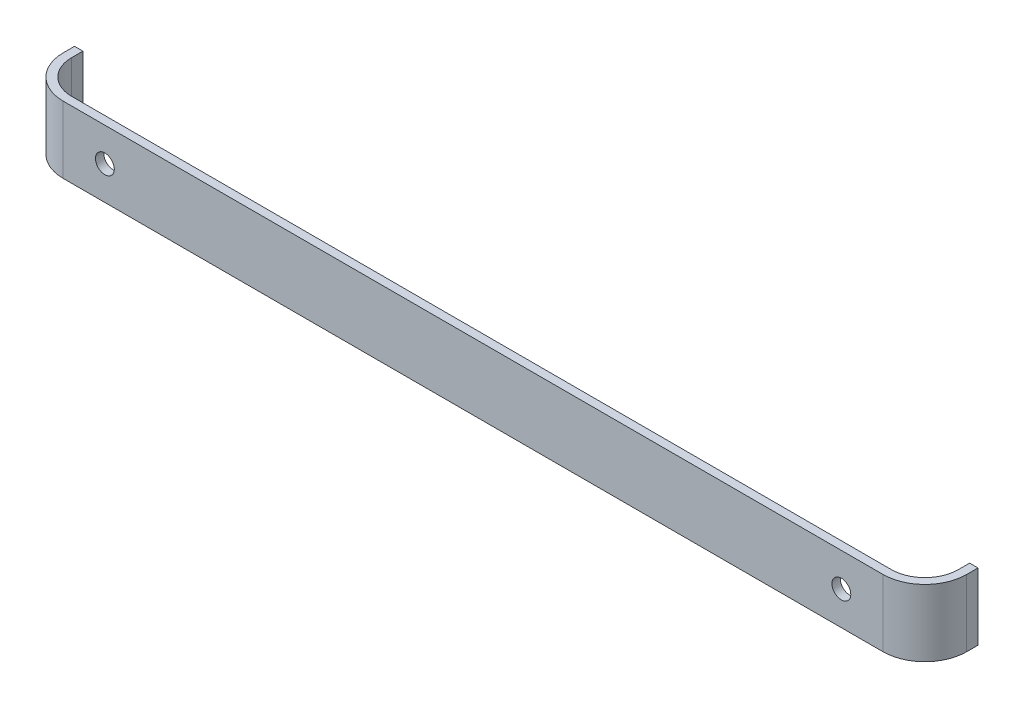
ISO-10303-21;
HEADER;
FILE_DESCRIPTION(('STEP AP214'),'2;1');
FILE_NAME('part.step','',(''),(''),'','','');
FILE_SCHEMA(('AUTOMOTIVE_DESIGN { 1 0 10303 214 1 1 1 1 }'));
ENDSEC;
DATA;
#1=APPLICATION_CONTEXT('core data for automotive mechanical design processes');
#2=APPLICATION_PROTOCOL_DEFINITION('international standard','automotive_design',2000,#1);
#3=PRODUCT_CONTEXT('',#1,'mechanical');
#4=PRODUCT('Part','Part','',(#3));
#5=PRODUCT_RELATED_PRODUCT_CATEGORY('part','',(#4));
#6=PRODUCT_DEFINITION_FORMATION('','',#4);
#7=PRODUCT_DEFINITION_CONTEXT('part definition',#1,'design');
#8=PRODUCT_DEFINITION('design','',#6,#7);
#9=PRODUCT_DEFINITION_SHAPE('','',#8);
#10=(LENGTH_UNIT() NAMED_UNIT(*) SI_UNIT(.MILLI.,.METRE.));
#11=(NAMED_UNIT(*) PLANE_ANGLE_UNIT() SI_UNIT($,.RADIAN.));
#12=(NAMED_UNIT(*) SI_UNIT($,.STERADIAN.) SOLID_ANGLE_UNIT());
#13=UNCERTAINTY_MEASURE_WITH_UNIT(LENGTH_MEASURE(1.E-05),#10,'distance_accuracy_value','');
#14=(GEOMETRIC_REPRESENTATION_CONTEXT(3) GLOBAL_UNCERTAINTY_ASSIGNED_CONTEXT((#13)) GLOBAL_UNIT_ASSIGNED_CONTEXT((#10,
#11,#12)) REPRESENTATION_CONTEXT('',''));
#15=CARTESIAN_POINT('',(0.,0.,0.));
#16=DIRECTION('',(0.,0.,1.));
#17=DIRECTION('',(1.,0.,0.));
#18=AXIS2_PLACEMENT_3D('',#15,#16,#17);
#19=CARTESIAN_POINT('',(0.,16.,-10.7));
#20=DIRECTION('',(-1.,0.,0.));
#21=DIRECTION('',(0.,0.,1.));
#22=AXIS2_PLACEMENT_3D('',#19,#20,#21);
#23=PLANE('',#22);
#24=DIRECTION('',(0.,0.,-1.));
#25=VECTOR('',#24,1.);
#26=CARTESIAN_POINT('',(0.,16.,-10.7));
#27=LINE('',#26,#25);
#28=CARTESIAN_POINT('',(0.,16.,-8.));
#29=VERTEX_POINT('',#28);
#30=CARTESIAN_POINT('',(0.,16.,-10.7));
#31=VERTEX_POINT('',#30);
#32=EDGE_CURVE('E125',#29,#31,#27,.T.);
#33=ORIENTED_EDGE('',*,*,#32,.F.);
#34=DIRECTION('',(0.,-1.,0.));
#35=VECTOR('',#34,1.);
#36=CARTESIAN_POINT('',(0.,0.,-8.));
#37=LINE('',#36,#35);
#38=CARTESIAN_POINT('',(0.,0.,-8.));
#39=VERTEX_POINT('',#38);
#40=EDGE_CURVE('E162',#29,#39,#37,.T.);
#41=ORIENTED_EDGE('',*,*,#40,.T.);
#42=DIRECTION('',(0.,0.,-1.));
#43=VECTOR('',#42,1.);
#44=CARTESIAN_POINT('',(0.,0.,-10.7));
#45=LINE('',#44,#43);
#46=CARTESIAN_POINT('',(0.,0.,-10.7));
#47=VERTEX_POINT('',#46);
#48=EDGE_CURVE('E148',#39,#47,#45,.T.);
#49=ORIENTED_EDGE('',*,*,#48,.T.);
#50=DIRECTION('',(0.,-1.,0.));
#51=VECTOR('',#50,1.);
#52=CARTESIAN_POINT('',(0.,16.,-10.7));
#53=LINE('',#52,#51);
#54=EDGE_CURVE('E142',#31,#47,#53,.T.);
#55=ORIENTED_EDGE('',*,*,#54,.F.);
#56=EDGE_LOOP('',(#33,#41,#49,#55));
#57=FACE_BOUND('',#56,.T.);
#58=ADVANCED_FACE('F33',(#57),#23,.F.);
#59=CARTESIAN_POINT('',(-2.,16.,-10.7));
#60=DIRECTION('',(0.,0.,1.));
#61=DIRECTION('',(1.,0.,0.));
#62=AXIS2_PLACEMENT_3D('',#59,#60,#61);
#63=PLANE('',#62);
#64=DIRECTION('',(-1.,0.,0.));
#65=VECTOR('',#64,1.);
#66=CARTESIAN_POINT('',(-2.,0.,-10.7));
#67=LINE('',#66,#65);
#68=CARTESIAN_POINT('',(-2.,0.,-10.7));
#69=VERTEX_POINT('',#68);
#70=EDGE_CURVE('E187',#47,#69,#67,.T.);
#71=ORIENTED_EDGE('',*,*,#70,.T.);
#72=DIRECTION('',(0.,-1.,0.));
#73=VECTOR('',#72,1.);
#74=CARTESIAN_POINT('',(-2.,16.,-10.7));
#75=LINE('',#74,#73);
#76=CARTESIAN_POINT('',(-2.,16.,-10.7));
#77=VERTEX_POINT('',#76);
#78=EDGE_CURVE('E144',#77,#69,#75,.T.);
#79=ORIENTED_EDGE('',*,*,#78,.F.);
#80=DIRECTION('',(-1.,0.,0.));
#81=VECTOR('',#80,1.);
#82=CARTESIAN_POINT('',(-2.,16.,-10.7));
#83=LINE('',#82,#81);
#84=EDGE_CURVE('E128',#31,#77,#83,.T.);
#85=ORIENTED_EDGE('',*,*,#84,.F.);
#86=ORIENTED_EDGE('',*,*,#54,.T.);
#87=EDGE_LOOP('',(#71,#79,#85,#86));
#88=FACE_BOUND('',#87,.T.);
#89=ADVANCED_FACE('F141',(#88),#63,.F.);
#90=CARTESIAN_POINT('',(-2.,16.,2.));
#91=DIRECTION('',(1.,0.,0.));
#92=DIRECTION('',(0.,0.,-1.));
#93=AXIS2_PLACEMENT_3D('',#90,#91,#92);
#94=PLANE('',#93);
#95=DIRECTION('',(0.,0.,1.));
#96=VECTOR('',#95,1.);
#97=CARTESIAN_POINT('',(-2.,0.,2.));
#98=LINE('',#97,#96);
#99=CARTESIAN_POINT('',(-2.,0.,-8.00000000000001));
#100=VERTEX_POINT('',#99);
#101=EDGE_CURVE('E211',#69,#100,#98,.T.);
#102=ORIENTED_EDGE('',*,*,#101,.T.);
#103=DIRECTION('',(0.,-1.,0.));
#104=VECTOR('',#103,1.);
#105=CARTESIAN_POINT('',(-2.,16.,-8.00000000000001));
#106=LINE('',#105,#104);
#107=CARTESIAN_POINT('',(-2.,16.,-8.00000000000001));
#108=VERTEX_POINT('',#107);
#109=EDGE_CURVE('E58',#100,#108,#106,.F.);
#110=ORIENTED_EDGE('',*,*,#109,.T.);
#111=DIRECTION('',(0.,0.,1.));
#112=VECTOR('',#111,1.);
#113=CARTESIAN_POINT('',(-2.,16.,2.));
#114=LINE('',#113,#112);
#115=EDGE_CURVE('E145',#77,#108,#114,.T.);
#116=ORIENTED_EDGE('',*,*,#115,.F.);
#117=ORIENTED_EDGE('',*,*,#78,.T.);
#118=EDGE_LOOP('',(#102,#110,#116,#117));
#119=FACE_BOUND('',#118,.T.);
#120=ADVANCED_FACE('F255',(#119),#94,.F.);
#121=CARTESIAN_POINT('',(213.9,16.,1.99999999999997));
#122=DIRECTION('',(0.,0.,-1.));
#123=DIRECTION('',(-1.,0.,0.));
#124=AXIS2_PLACEMENT_3D('',#121,#122,#123);
#125=PLANE('',#124);
#126=CARTESIAN_POINT('',(193.95,8.00000000000003,2.));
#127=DIRECTION('',(0.,0.,1.));
#128=DIRECTION('',(1.,0.,0.));
#129=AXIS2_PLACEMENT_3D('',#126,#127,#128);
#130=CIRCLE('',#129,2.25000000000001);
#131=CARTESIAN_POINT('',(196.2,8.00000000000003,2.));
#132=VERTEX_POINT('',#131);
#133=EDGE_CURVE('E194',#132,#132,#130,.T.);
#134=ORIENTED_EDGE('',*,*,#133,.F.);
#135=EDGE_LOOP('',(#134));
#136=FACE_BOUND('',#135,.T.);
#137=CARTESIAN_POINT('',(17.95,8.00000000000001,2.));
#138=DIRECTION('',(0.,0.,1.));
#139=DIRECTION('',(1.,0.,0.));
#140=AXIS2_PLACEMENT_3D('',#137,#138,#139);
#141=CIRCLE('',#140,2.25);
#142=CARTESIAN_POINT('',(20.2,8.00000000000001,2.));
#143=VERTEX_POINT('',#142);
#144=EDGE_CURVE('E184',#143,#143,#141,.T.);
#145=ORIENTED_EDGE('',*,*,#144,.F.);
#146=EDGE_LOOP('',(#145));
#147=FACE_BOUND('',#146,.T.);
#148=DIRECTION('',(1.,0.,0.));
#149=VECTOR('',#148,1.);
#150=CARTESIAN_POINT('',(213.9,16.,1.99999999999997));
#151=LINE('',#150,#149);
#152=CARTESIAN_POINT('',(8.00000000000001,16.,2.));
#153=VERTEX_POINT('',#152);
#154=CARTESIAN_POINT('',(203.9,16.,1.99999999999997));
#155=VERTEX_POINT('',#154);
#156=EDGE_CURVE('E198',#153,#155,#151,.T.);
#157=ORIENTED_EDGE('',*,*,#156,.F.);
#158=DIRECTION('',(0.,-1.,0.));
#159=VECTOR('',#158,1.);
#160=CARTESIAN_POINT('',(8.00000000000001,16.,2.));
#161=LINE('',#160,#159);
#162=CARTESIAN_POINT('',(8.00000000000001,0.,2.));
#163=VERTEX_POINT('',#162);
#164=EDGE_CURVE('E173',#153,#163,#161,.T.);
#165=ORIENTED_EDGE('',*,*,#164,.T.);
#166=DIRECTION('',(1.,0.,0.));
#167=VECTOR('',#166,1.);
#168=CARTESIAN_POINT('',(213.9,0.,1.99999999999997));
#169=LINE('',#168,#167);
#170=CARTESIAN_POINT('',(203.9,0.,1.99999999999997));
#171=VERTEX_POINT('',#170);
#172=EDGE_CURVE('E213',#163,#171,#169,.T.);
#173=ORIENTED_EDGE('',*,*,#172,.T.);
#174=DIRECTION('',(0.,-1.,0.));
#175=VECTOR('',#174,1.);
#176=CARTESIAN_POINT('',(203.9,16.,1.99999999999997));
#177=LINE('',#176,#175);
#178=EDGE_CURVE('E171',#171,#155,#177,.F.);
#179=ORIENTED_EDGE('',*,*,#178,.T.);
#180=EDGE_LOOP('',(#157,#165,#173,#179));
#181=FACE_BOUND('',#180,.T.);
#182=ADVANCED_FACE('F262',(#136,#147,#181),#125,.F.);
#183=CARTESIAN_POINT('',(213.9,16.,-10.7));
#184=DIRECTION('',(-1.,0.,0.));
#185=DIRECTION('',(0.,0.,1.));
#186=AXIS2_PLACEMENT_3D('',#183,#184,#185);
#187=PLANE('',#186);
#188=DIRECTION('',(0.,0.,-1.));
#189=VECTOR('',#188,1.);
#190=CARTESIAN_POINT('',(213.9,16.,-10.7));
#191=LINE('',#190,#189);
#192=CARTESIAN_POINT('',(213.9,16.,-8.00000000000002));
#193=VERTEX_POINT('',#192);
#194=CARTESIAN_POINT('',(213.9,16.,-10.7));
#195=VERTEX_POINT('',#194);
#196=EDGE_CURVE('E200',#193,#195,#191,.T.);
#197=ORIENTED_EDGE('',*,*,#196,.F.);
#198=DIRECTION('',(0.,-1.,0.));
#199=VECTOR('',#198,1.);
#200=CARTESIAN_POINT('',(213.9,16.,-8.00000000000002));
#201=LINE('',#200,#199);
#202=CARTESIAN_POINT('',(213.9,0.,-8.00000000000002));
#203=VERTEX_POINT('',#202);
#204=EDGE_CURVE('E11',#193,#203,#201,.T.);
#205=ORIENTED_EDGE('',*,*,#204,.T.);
#206=DIRECTION('',(0.,0.,-1.));
#207=VECTOR('',#206,1.);
#208=CARTESIAN_POINT('',(213.9,0.,-10.7));
#209=LINE('',#208,#207);
#210=CARTESIAN_POINT('',(213.9,0.,-10.7));
#211=VERTEX_POINT('',#210);
#212=EDGE_CURVE('E216',#203,#211,#209,.T.);
#213=ORIENTED_EDGE('',*,*,#212,.T.);
#214=DIRECTION('',(0.,-1.,0.));
#215=VECTOR('',#214,1.);
#216=CARTESIAN_POINT('',(213.9,16.,-10.7));
#217=LINE('',#216,#215);
#218=EDGE_CURVE('E154',#195,#211,#217,.T.);
#219=ORIENTED_EDGE('',*,*,#218,.F.);
#220=EDGE_LOOP('',(#197,#205,#213,#219));
#221=FACE_BOUND('',#220,.T.);
#222=ADVANCED_FACE('F266',(#221),#187,.F.);
#223=CARTESIAN_POINT('',(211.9,16.,-10.7));
#224=DIRECTION('',(0.,0.,1.));
#225=DIRECTION('',(1.,0.,0.));
#226=AXIS2_PLACEMENT_3D('',#223,#224,#225);
#227=PLANE('',#226);
#228=DIRECTION('',(-1.,0.,0.));
#229=VECTOR('',#228,1.);
#230=CARTESIAN_POINT('',(211.9,0.,-10.7));
#231=LINE('',#230,#229);
#232=CARTESIAN_POINT('',(211.9,0.,-10.7));
#233=VERTEX_POINT('',#232);
#234=EDGE_CURVE('E218',#211,#233,#231,.T.);
#235=ORIENTED_EDGE('',*,*,#234,.T.);
#236=DIRECTION('',(0.,-1.,0.));
#237=VECTOR('',#236,1.);
#238=CARTESIAN_POINT('',(211.9,16.,-10.7));
#239=LINE('',#238,#237);
#240=CARTESIAN_POINT('',(211.9,16.,-10.7));
#241=VERTEX_POINT('',#240);
#242=EDGE_CURVE('E208',#241,#233,#239,.T.);
#243=ORIENTED_EDGE('',*,*,#242,.F.);
#244=DIRECTION('',(-1.,0.,0.));
#245=VECTOR('',#244,1.);
#246=CARTESIAN_POINT('',(211.9,16.,-10.7));
#247=LINE('',#246,#245);
#248=EDGE_CURVE('E202',#195,#241,#247,.T.);
#249=ORIENTED_EDGE('',*,*,#248,.F.);
#250=ORIENTED_EDGE('',*,*,#218,.T.);
#251=EDGE_LOOP('',(#235,#243,#249,#250));
#252=FACE_BOUND('',#251,.T.);
#253=ADVANCED_FACE('F231',(#252),#227,.F.);
#254=CARTESIAN_POINT('',(211.9,16.,0.));
#255=DIRECTION('',(1.,0.,0.));
#256=DIRECTION('',(0.,0.,-1.));
#257=AXIS2_PLACEMENT_3D('',#254,#255,#256);
#258=PLANE('',#257);
#259=DIRECTION('',(0.,0.,1.));
#260=VECTOR('',#259,1.);
#261=CARTESIAN_POINT('',(211.9,0.,0.));
#262=LINE('',#261,#260);
#263=CARTESIAN_POINT('',(211.9,0.,-8.));
#264=VERTEX_POINT('',#263);
#265=EDGE_CURVE('E220',#233,#264,#262,.T.);
#266=ORIENTED_EDGE('',*,*,#265,.T.);
#267=DIRECTION('',(0.,-1.,0.));
#268=VECTOR('',#267,1.);
#269=CARTESIAN_POINT('',(211.9,16.,-8.));
#270=LINE('',#269,#268);
#271=CARTESIAN_POINT('',(211.9,16.,-8.));
#272=VERTEX_POINT('',#271);
#273=EDGE_CURVE('E160',#264,#272,#270,.F.);
#274=ORIENTED_EDGE('',*,*,#273,.T.);
#275=DIRECTION('',(0.,0.,1.));
#276=VECTOR('',#275,1.);
#277=CARTESIAN_POINT('',(211.9,16.,0.));
#278=LINE('',#277,#276);
#279=EDGE_CURVE('E204',#241,#272,#278,.T.);
#280=ORIENTED_EDGE('',*,*,#279,.F.);
#281=ORIENTED_EDGE('',*,*,#242,.T.);
#282=EDGE_LOOP('',(#266,#274,#280,#281));
#283=FACE_BOUND('',#282,.T.);
#284=ADVANCED_FACE('F242',(#283),#258,.F.);
#285=CARTESIAN_POINT('',(0.,16.,0.));
#286=DIRECTION('',(0.,0.,1.));
#287=DIRECTION('',(1.,0.,0.));
#288=AXIS2_PLACEMENT_3D('',#285,#286,#287);
#289=PLANE('',#288);
#290=CARTESIAN_POINT('',(193.95,8.00000000000003,0.));
#291=DIRECTION('',(0.,0.,1.));
#292=DIRECTION('',(1.,0.,0.));
#293=AXIS2_PLACEMENT_3D('',#290,#291,#292);
#294=CIRCLE('',#293,2.25000000000001);
#295=CARTESIAN_POINT('',(196.2,8.00000000000003,0.));
#296=VERTEX_POINT('',#295);
#297=EDGE_CURVE('E37',#296,#296,#294,.T.);
#298=ORIENTED_EDGE('',*,*,#297,.T.);
#299=EDGE_LOOP('',(#298));
#300=FACE_BOUND('',#299,.T.);
#301=CARTESIAN_POINT('',(17.95,8.00000000000001,0.));
#302=DIRECTION('',(0.,0.,1.));
#303=DIRECTION('',(1.,0.,0.));
#304=AXIS2_PLACEMENT_3D('',#301,#302,#303);
#305=CIRCLE('',#304,2.25);
#306=CARTESIAN_POINT('',(20.2,8.00000000000001,0.));
#307=VERTEX_POINT('',#306);
#308=EDGE_CURVE('E182',#307,#307,#305,.T.);
#309=ORIENTED_EDGE('',*,*,#308,.T.);
#310=EDGE_LOOP('',(#309));
#311=FACE_BOUND('',#310,.T.);
#312=DIRECTION('',(-1.,0.,0.));
#313=VECTOR('',#312,1.);
#314=CARTESIAN_POINT('',(0.,16.,0.));
#315=LINE('',#314,#313);
#316=CARTESIAN_POINT('',(203.9,16.,0.));
#317=VERTEX_POINT('',#316);
#318=CARTESIAN_POINT('',(8.,16.,0.));
#319=VERTEX_POINT('',#318);
#320=EDGE_CURVE('E207',#317,#319,#315,.T.);
#321=ORIENTED_EDGE('',*,*,#320,.F.);
#322=DIRECTION('',(0.,-1.,0.));
#323=VECTOR('',#322,1.);
#324=CARTESIAN_POINT('',(203.9,0.,0.));
#325=LINE('',#324,#323);
#326=CARTESIAN_POINT('',(203.9,0.,0.));
#327=VERTEX_POINT('',#326);
#328=EDGE_CURVE('E152',#317,#327,#325,.T.);
#329=ORIENTED_EDGE('',*,*,#328,.T.);
#330=DIRECTION('',(-1.,0.,0.));
#331=VECTOR('',#330,1.);
#332=CARTESIAN_POINT('',(0.,0.,0.));
#333=LINE('',#332,#331);
#334=CARTESIAN_POINT('',(8.,0.,0.));
#335=VERTEX_POINT('',#334);
#336=EDGE_CURVE('E137',#327,#335,#333,.T.);
#337=ORIENTED_EDGE('',*,*,#336,.T.);
#338=DIRECTION('',(0.,-1.,0.));
#339=VECTOR('',#338,1.);
#340=CARTESIAN_POINT('',(8.,16.,0.));
#341=LINE('',#340,#339);
#342=EDGE_CURVE('E150',#335,#319,#341,.F.);
#343=ORIENTED_EDGE('',*,*,#342,.T.);
#344=EDGE_LOOP('',(#321,#329,#337,#343));
#345=FACE_BOUND('',#344,.T.);
#346=ADVANCED_FACE('F250',(#300,#311,#345),#289,.F.);
#347=CARTESIAN_POINT('',(0.,16.,0.));
#348=DIRECTION('',(0.,1.,0.));
#349=DIRECTION('',(0.,0.,1.));
#350=AXIS2_PLACEMENT_3D('',#347,#348,#349);
#351=PLANE('',#350);
#352=ORIENTED_EDGE('',*,*,#115,.T.);
#353=CARTESIAN_POINT('',(8.00000000000001,16.,-8.00000000000001));
#354=DIRECTION('',(0.,1.,0.));
#355=DIRECTION('',(0.,0.,1.));
#356=AXIS2_PLACEMENT_3D('',#353,#354,#355);
#357=CIRCLE('',#356,10.);
#358=EDGE_CURVE('E42',#108,#153,#357,.T.);
#359=ORIENTED_EDGE('',*,*,#358,.T.);
#360=ORIENTED_EDGE('',*,*,#156,.T.);
#361=CARTESIAN_POINT('',(203.9,16.,-8.00000000000002));
#362=DIRECTION('',(0.,1.,0.));
#363=DIRECTION('',(0.,0.,1.));
#364=AXIS2_PLACEMENT_3D('',#361,#362,#363);
#365=CIRCLE('',#364,10.);
#366=EDGE_CURVE('E50',#155,#193,#365,.T.);
#367=ORIENTED_EDGE('',*,*,#366,.T.);
#368=ORIENTED_EDGE('',*,*,#196,.T.);
#369=ORIENTED_EDGE('',*,*,#248,.T.);
#370=ORIENTED_EDGE('',*,*,#279,.T.);
#371=CARTESIAN_POINT('',(203.9,16.,-8.));
#372=DIRECTION('',(0.,1.,0.));
#373=DIRECTION('',(0.,0.,1.));
#374=AXIS2_PLACEMENT_3D('',#371,#372,#373);
#375=CIRCLE('',#374,8.);
#376=EDGE_CURVE('E166',#272,#317,#375,.F.);
#377=ORIENTED_EDGE('',*,*,#376,.T.);
#378=ORIENTED_EDGE('',*,*,#320,.T.);
#379=CARTESIAN_POINT('',(8.,16.,-8.));
#380=DIRECTION('',(0.,1.,0.));
#381=DIRECTION('',(0.,0.,1.));
#382=AXIS2_PLACEMENT_3D('',#379,#380,#381);
#383=CIRCLE('',#382,8.);
#384=EDGE_CURVE('E132',#319,#29,#383,.F.);
#385=ORIENTED_EDGE('',*,*,#384,.T.);
#386=ORIENTED_EDGE('',*,*,#32,.T.);
#387=ORIENTED_EDGE('',*,*,#84,.T.);
#388=EDGE_LOOP('',(#352,#359,#360,#367,#368,#369,#370,#377,#378,#385,#386,#387));
#389=FACE_BOUND('',#388,.T.);
#390=ADVANCED_FACE('F127',(#389),#351,.T.);
#391=CARTESIAN_POINT('',(0.,0.,0.));
#392=DIRECTION('',(0.,1.,0.));
#393=DIRECTION('',(0.,0.,1.));
#394=AXIS2_PLACEMENT_3D('',#391,#392,#393);
#395=PLANE('',#394);
#396=ORIENTED_EDGE('',*,*,#172,.F.);
#397=CARTESIAN_POINT('',(8.00000000000001,0.,-8.00000000000001));
#398=DIRECTION('',(0.,1.,0.));
#399=DIRECTION('',(0.,0.,1.));
#400=AXIS2_PLACEMENT_3D('',#397,#398,#399);
#401=CIRCLE('',#400,10.);
#402=EDGE_CURVE('E178',#163,#100,#401,.F.);
#403=ORIENTED_EDGE('',*,*,#402,.T.);
#404=ORIENTED_EDGE('',*,*,#101,.F.);
#405=ORIENTED_EDGE('',*,*,#70,.F.);
#406=ORIENTED_EDGE('',*,*,#48,.F.);
#407=CARTESIAN_POINT('',(8.,0.,-8.));
#408=DIRECTION('',(0.,1.,0.));
#409=DIRECTION('',(0.,0.,1.));
#410=AXIS2_PLACEMENT_3D('',#407,#408,#409);
#411=CIRCLE('',#410,8.);
#412=EDGE_CURVE('E168',#39,#335,#411,.T.);
#413=ORIENTED_EDGE('',*,*,#412,.T.);
#414=ORIENTED_EDGE('',*,*,#336,.F.);
#415=CARTESIAN_POINT('',(203.9,0.,-8.));
#416=DIRECTION('',(0.,1.,0.));
#417=DIRECTION('',(0.,0.,1.));
#418=AXIS2_PLACEMENT_3D('',#415,#416,#417);
#419=CIRCLE('',#418,8.);
#420=EDGE_CURVE('E164',#327,#264,#419,.T.);
#421=ORIENTED_EDGE('',*,*,#420,.T.);
#422=ORIENTED_EDGE('',*,*,#265,.F.);
#423=ORIENTED_EDGE('',*,*,#234,.F.);
#424=ORIENTED_EDGE('',*,*,#212,.F.);
#425=CARTESIAN_POINT('',(203.9,0.,-8.00000000000002));
#426=DIRECTION('',(0.,1.,0.));
#427=DIRECTION('',(0.,0.,1.));
#428=AXIS2_PLACEMENT_3D('',#425,#426,#427);
#429=CIRCLE('',#428,10.);
#430=EDGE_CURVE('E176',#203,#171,#429,.F.);
#431=ORIENTED_EDGE('',*,*,#430,.T.);
#432=EDGE_LOOP('',(#396,#403,#404,#405,#406,#413,#414,#421,#422,#423,#424,#431));
#433=FACE_BOUND('',#432,.T.);
#434=ADVANCED_FACE('F238',(#433),#395,.F.);
#435=CARTESIAN_POINT('',(203.9,16.,-8.));
#436=DIRECTION('',(0.,1.,0.));
#437=DIRECTION('',(0.,0.,1.));
#438=AXIS2_PLACEMENT_3D('',#435,#436,#437);
#439=CYLINDRICAL_SURFACE('',#438,8.);
#440=ORIENTED_EDGE('',*,*,#376,.F.);
#441=ORIENTED_EDGE('',*,*,#273,.F.);
#442=ORIENTED_EDGE('',*,*,#420,.F.);
#443=ORIENTED_EDGE('',*,*,#328,.F.);
#444=EDGE_LOOP('',(#440,#441,#442,#443));
#445=FACE_BOUND('',#444,.T.);
#446=ADVANCED_FACE('F246',(#445),#439,.F.);
#447=CARTESIAN_POINT('',(8.,16.,-8.));
#448=DIRECTION('',(0.,1.,0.));
#449=DIRECTION('',(0.,0.,1.));
#450=AXIS2_PLACEMENT_3D('',#447,#448,#449);
#451=CYLINDRICAL_SURFACE('',#450,8.);
#452=ORIENTED_EDGE('',*,*,#384,.F.);
#453=ORIENTED_EDGE('',*,*,#342,.F.);
#454=ORIENTED_EDGE('',*,*,#412,.F.);
#455=ORIENTED_EDGE('',*,*,#40,.F.);
#456=EDGE_LOOP('',(#452,#453,#454,#455));
#457=FACE_BOUND('',#456,.T.);
#458=ADVANCED_FACE('F253',(#457),#451,.F.);
#459=CARTESIAN_POINT('',(8.00000000000001,16.,-8.00000000000001));
#460=DIRECTION('',(0.,-1.,0.));
#461=DIRECTION('',(0.,0.,-1.));
#462=AXIS2_PLACEMENT_3D('',#459,#460,#461);
#463=CYLINDRICAL_SURFACE('',#462,10.);
#464=ORIENTED_EDGE('',*,*,#358,.F.);
#465=ORIENTED_EDGE('',*,*,#109,.F.);
#466=ORIENTED_EDGE('',*,*,#402,.F.);
#467=ORIENTED_EDGE('',*,*,#164,.F.);
#468=EDGE_LOOP('',(#464,#465,#466,#467));
#469=FACE_BOUND('',#468,.T.);
#470=ADVANCED_FACE('F260',(#469),#463,.T.);
#471=CARTESIAN_POINT('',(203.9,16.,-8.00000000000002));
#472=DIRECTION('',(0.,-1.,0.));
#473=DIRECTION('',(0.,0.,-1.));
#474=AXIS2_PLACEMENT_3D('',#471,#472,#473);
#475=CYLINDRICAL_SURFACE('',#474,10.);
#476=ORIENTED_EDGE('',*,*,#366,.F.);
#477=ORIENTED_EDGE('',*,*,#178,.F.);
#478=ORIENTED_EDGE('',*,*,#430,.F.);
#479=ORIENTED_EDGE('',*,*,#204,.F.);
#480=EDGE_LOOP('',(#476,#477,#478,#479));
#481=FACE_BOUND('',#480,.T.);
#482=ADVANCED_FACE('F35',(#481),#475,.T.);
#483=CARTESIAN_POINT('',(17.95,8.00000000000001,-10.7));
#484=DIRECTION('',(0.,0.,1.));
#485=DIRECTION('',(1.,0.,0.));
#486=AXIS2_PLACEMENT_3D('',#483,#484,#485);
#487=CYLINDRICAL_SURFACE('',#486,2.25);
#488=ORIENTED_EDGE('',*,*,#144,.T.);
#489=EDGE_LOOP('',(#488));
#490=FACE_BOUND('',#489,.T.);
#491=ORIENTED_EDGE('',*,*,#308,.F.);
#492=EDGE_LOOP('',(#491));
#493=FACE_BOUND('',#492,.T.);
#494=ADVANCED_FACE('F291',(#490,#493),#487,.F.);
#495=CARTESIAN_POINT('',(193.95,8.00000000000003,-10.7));
#496=DIRECTION('',(0.,0.,1.));
#497=DIRECTION('',(1.,0.,0.));
#498=AXIS2_PLACEMENT_3D('',#495,#496,#497);
#499=CYLINDRICAL_SURFACE('',#498,2.25000000000001);
#500=ORIENTED_EDGE('',*,*,#133,.T.);
#501=EDGE_LOOP('',(#500));
#502=FACE_BOUND('',#501,.T.);
#503=ORIENTED_EDGE('',*,*,#297,.F.);
#504=EDGE_LOOP('',(#503));
#505=FACE_BOUND('',#504,.T.);
#506=ADVANCED_FACE('F295',(#502,#505),#499,.F.);
#507=CLOSED_SHELL('',(#58,#89,#120,#182,#222,#253,#284,#346,#390,#434,#446,#458,#470,#482,#494,#506));
#508=MANIFOLD_SOLID_BREP('B2',#507);
#509=ADVANCED_BREP_SHAPE_REPRESENTATION('',(#18,#508),#14);
#510=SHAPE_DEFINITION_REPRESENTATION(#9,#509);
ENDSEC;
END-ISO-10303-21;
